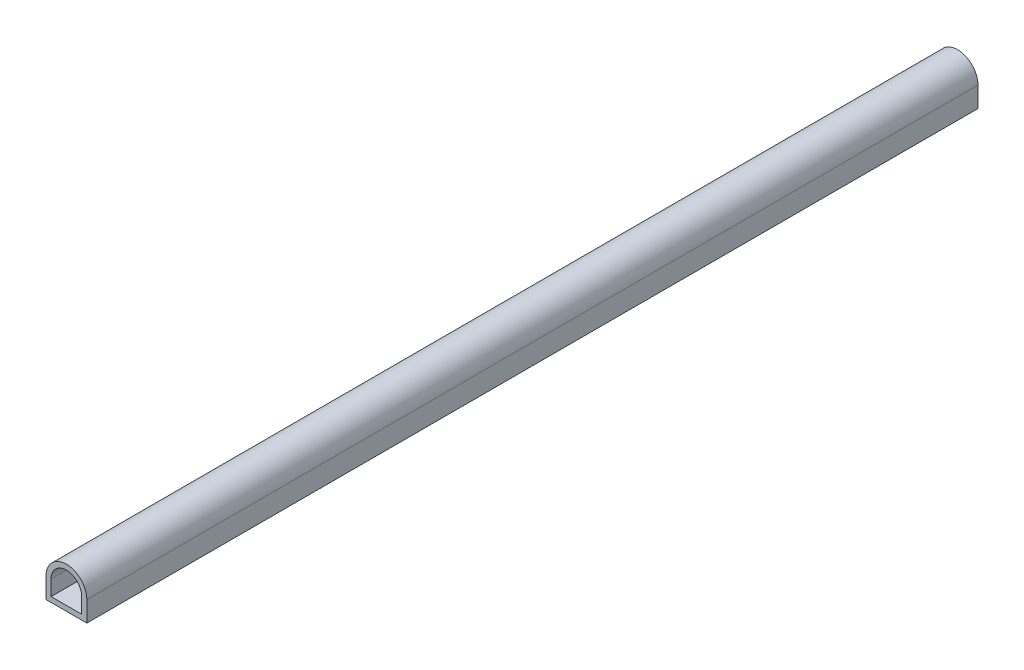
ISO-10303-21;
HEADER;
FILE_DESCRIPTION(('STEP AP214'),'2;1');
FILE_NAME('part.step','',(''),(''),'','','');
FILE_SCHEMA(('AUTOMOTIVE_DESIGN { 1 0 10303 214 1 1 1 1 }'));
ENDSEC;
DATA;
#1=APPLICATION_CONTEXT('core data for automotive mechanical design processes');
#2=APPLICATION_PROTOCOL_DEFINITION('international standard','automotive_design',2000,#1);
#3=PRODUCT_CONTEXT('',#1,'mechanical');
#4=PRODUCT('Part','Part','',(#3));
#5=PRODUCT_RELATED_PRODUCT_CATEGORY('part','',(#4));
#6=PRODUCT_DEFINITION_FORMATION('','',#4);
#7=PRODUCT_DEFINITION_CONTEXT('part definition',#1,'design');
#8=PRODUCT_DEFINITION('design','',#6,#7);
#9=PRODUCT_DEFINITION_SHAPE('','',#8);
#10=(LENGTH_UNIT() NAMED_UNIT(*) SI_UNIT(.MILLI.,.METRE.));
#11=(NAMED_UNIT(*) PLANE_ANGLE_UNIT() SI_UNIT($,.RADIAN.));
#12=(NAMED_UNIT(*) SI_UNIT($,.STERADIAN.) SOLID_ANGLE_UNIT());
#13=UNCERTAINTY_MEASURE_WITH_UNIT(LENGTH_MEASURE(1.E-05),#10,'distance_accuracy_value','');
#14=(GEOMETRIC_REPRESENTATION_CONTEXT(3) GLOBAL_UNCERTAINTY_ASSIGNED_CONTEXT((#13)) GLOBAL_UNIT_ASSIGNED_CONTEXT((#10,
#11,#12)) REPRESENTATION_CONTEXT('',''));
#15=CARTESIAN_POINT('',(0.,0.,0.));
#16=DIRECTION('',(0.,0.,1.));
#17=DIRECTION('',(1.,0.,0.));
#18=AXIS2_PLACEMENT_3D('',#15,#16,#17);
#19=CARTESIAN_POINT('',(0.,0.,131.));
#20=DIRECTION('',(0.,0.,1.));
#21=DIRECTION('',(1.,0.,0.));
#22=AXIS2_PLACEMENT_3D('',#19,#20,#21);
#23=PLANE('',#22);
#24=DIRECTION('',(0.,-1.,0.));
#25=VECTOR('',#24,1.);
#26=CARTESIAN_POINT('',(-3.,-3.,131.));
#27=LINE('',#26,#25);
#28=CARTESIAN_POINT('',(-3.,0.,131.));
#29=VERTEX_POINT('',#28);
#30=CARTESIAN_POINT('',(-3.,-3.,131.));
#31=VERTEX_POINT('',#30);
#32=EDGE_CURVE('E131',#29,#31,#27,.T.);
#33=ORIENTED_EDGE('',*,*,#32,.T.);
#34=DIRECTION('',(1.,0.,0.));
#35=VECTOR('',#34,1.);
#36=CARTESIAN_POINT('',(-3.,-3.,131.));
#37=LINE('',#36,#35);
#38=CARTESIAN_POINT('',(3.,-3.,131.));
#39=VERTEX_POINT('',#38);
#40=EDGE_CURVE('E134',#31,#39,#37,.T.);
#41=ORIENTED_EDGE('',*,*,#40,.T.);
#42=DIRECTION('',(0.,1.,0.));
#43=VECTOR('',#42,1.);
#44=CARTESIAN_POINT('',(3.,-3.,131.));
#45=LINE('',#44,#43);
#46=CARTESIAN_POINT('',(3.,0.,131.));
#47=VERTEX_POINT('',#46);
#48=EDGE_CURVE('E137',#39,#47,#45,.T.);
#49=ORIENTED_EDGE('',*,*,#48,.T.);
#50=CARTESIAN_POINT('',(0.,0.,131.));
#51=DIRECTION('',(0.,0.,1.));
#52=DIRECTION('',(1.,0.,0.));
#53=AXIS2_PLACEMENT_3D('',#50,#51,#52);
#54=CIRCLE('',#53,3.);
#55=EDGE_CURVE('E139',#47,#29,#54,.T.);
#56=ORIENTED_EDGE('',*,*,#55,.T.);
#57=EDGE_LOOP('',(#33,#41,#49,#56));
#58=FACE_BOUND('',#57,.T.);
#59=DIRECTION('',(1.,0.,0.));
#60=VECTOR('',#59,1.);
#61=CARTESIAN_POINT('',(-2.25,-2.25,131.));
#62=LINE('',#61,#60);
#63=CARTESIAN_POINT('',(-2.25,-2.25,131.));
#64=VERTEX_POINT('',#63);
#65=CARTESIAN_POINT('',(2.25,-2.25,131.));
#66=VERTEX_POINT('',#65);
#67=EDGE_CURVE('E103',#64,#66,#62,.T.);
#68=ORIENTED_EDGE('',*,*,#67,.F.);
#69=DIRECTION('',(0.,-1.,0.));
#70=VECTOR('',#69,1.);
#71=CARTESIAN_POINT('',(-2.25,-2.25,131.));
#72=LINE('',#71,#70);
#73=CARTESIAN_POINT('',(-2.25,0.,131.));
#74=VERTEX_POINT('',#73);
#75=EDGE_CURVE('E95',#74,#64,#72,.T.);
#76=ORIENTED_EDGE('',*,*,#75,.F.);
#77=CARTESIAN_POINT('',(0.,0.,131.));
#78=DIRECTION('',(0.,0.,1.));
#79=DIRECTION('',(1.,0.,0.));
#80=AXIS2_PLACEMENT_3D('',#77,#78,#79);
#81=CIRCLE('',#80,2.25);
#82=CARTESIAN_POINT('',(2.25,0.,131.));
#83=VERTEX_POINT('',#82);
#84=EDGE_CURVE('E117',#83,#74,#81,.T.);
#85=ORIENTED_EDGE('',*,*,#84,.F.);
#86=DIRECTION('',(0.,1.,0.));
#87=VECTOR('',#86,1.);
#88=CARTESIAN_POINT('',(2.25,-2.25,131.));
#89=LINE('',#88,#87);
#90=EDGE_CURVE('E115',#66,#83,#89,.T.);
#91=ORIENTED_EDGE('',*,*,#90,.F.);
#92=EDGE_LOOP('',(#68,#76,#85,#91));
#93=FACE_BOUND('',#92,.T.);
#94=ADVANCED_FACE('F30',(#58,#93),#23,.T.);
#95=CARTESIAN_POINT('',(0.,0.,0.));
#96=DIRECTION('',(0.,0.,1.));
#97=DIRECTION('',(1.,0.,0.));
#98=AXIS2_PLACEMENT_3D('',#95,#96,#97);
#99=PLANE('',#98);
#100=DIRECTION('',(0.,-1.,0.));
#101=VECTOR('',#100,1.);
#102=CARTESIAN_POINT('',(-3.,-3.,0.));
#103=LINE('',#102,#101);
#104=CARTESIAN_POINT('',(-3.,0.,0.));
#105=VERTEX_POINT('',#104);
#106=CARTESIAN_POINT('',(-3.,-3.,0.));
#107=VERTEX_POINT('',#106);
#108=EDGE_CURVE('E111',#105,#107,#103,.T.);
#109=ORIENTED_EDGE('',*,*,#108,.F.);
#110=CARTESIAN_POINT('',(0.,0.,0.));
#111=DIRECTION('',(0.,0.,1.));
#112=DIRECTION('',(1.,0.,0.));
#113=AXIS2_PLACEMENT_3D('',#110,#111,#112);
#114=CIRCLE('',#113,3.);
#115=CARTESIAN_POINT('',(3.,0.,0.));
#116=VERTEX_POINT('',#115);
#117=EDGE_CURVE('E135',#116,#105,#114,.T.);
#118=ORIENTED_EDGE('',*,*,#117,.F.);
#119=DIRECTION('',(0.,1.,0.));
#120=VECTOR('',#119,1.);
#121=CARTESIAN_POINT('',(3.,-3.,0.));
#122=LINE('',#121,#120);
#123=CARTESIAN_POINT('',(3.,-3.,0.));
#124=VERTEX_POINT('',#123);
#125=EDGE_CURVE('E146',#124,#116,#122,.T.);
#126=ORIENTED_EDGE('',*,*,#125,.F.);
#127=DIRECTION('',(1.,0.,0.));
#128=VECTOR('',#127,1.);
#129=CARTESIAN_POINT('',(-3.,-3.,0.));
#130=LINE('',#129,#128);
#131=EDGE_CURVE('E144',#107,#124,#130,.T.);
#132=ORIENTED_EDGE('',*,*,#131,.F.);
#133=EDGE_LOOP('',(#109,#118,#126,#132));
#134=FACE_BOUND('',#133,.T.);
#135=DIRECTION('',(0.,-1.,0.));
#136=VECTOR('',#135,1.);
#137=CARTESIAN_POINT('',(-2.25,-2.25,0.));
#138=LINE('',#137,#136);
#139=CARTESIAN_POINT('',(-2.25,0.,0.));
#140=VERTEX_POINT('',#139);
#141=CARTESIAN_POINT('',(-2.25,-2.25,0.));
#142=VERTEX_POINT('',#141);
#143=EDGE_CURVE('E53',#140,#142,#138,.T.);
#144=ORIENTED_EDGE('',*,*,#143,.T.);
#145=DIRECTION('',(1.,0.,0.));
#146=VECTOR('',#145,1.);
#147=CARTESIAN_POINT('',(-2.25,-2.25,0.));
#148=LINE('',#147,#146);
#149=CARTESIAN_POINT('',(2.25,-2.25,0.));
#150=VERTEX_POINT('',#149);
#151=EDGE_CURVE('E110',#142,#150,#148,.T.);
#152=ORIENTED_EDGE('',*,*,#151,.T.);
#153=DIRECTION('',(0.,1.,0.));
#154=VECTOR('',#153,1.);
#155=CARTESIAN_POINT('',(2.25,-2.25,0.));
#156=LINE('',#155,#154);
#157=CARTESIAN_POINT('',(2.25,0.,0.));
#158=VERTEX_POINT('',#157);
#159=EDGE_CURVE('E123',#150,#158,#156,.T.);
#160=ORIENTED_EDGE('',*,*,#159,.T.);
#161=CARTESIAN_POINT('',(0.,0.,0.));
#162=DIRECTION('',(0.,0.,1.));
#163=DIRECTION('',(1.,0.,0.));
#164=AXIS2_PLACEMENT_3D('',#161,#162,#163);
#165=CIRCLE('',#164,2.25);
#166=EDGE_CURVE('E104',#158,#140,#165,.T.);
#167=ORIENTED_EDGE('',*,*,#166,.T.);
#168=EDGE_LOOP('',(#144,#152,#160,#167));
#169=FACE_BOUND('',#168,.T.);
#170=ADVANCED_FACE('F164',(#134,#169),#99,.F.);
#171=CARTESIAN_POINT('',(-3.,-3.,131.));
#172=DIRECTION('',(1.,0.,0.));
#173=DIRECTION('',(0.,0.,-1.));
#174=AXIS2_PLACEMENT_3D('',#171,#172,#173);
#175=PLANE('',#174);
#176=ORIENTED_EDGE('',*,*,#108,.T.);
#177=DIRECTION('',(0.,0.,-1.));
#178=VECTOR('',#177,1.);
#179=CARTESIAN_POINT('',(-3.,-3.,131.));
#180=LINE('',#179,#178);
#181=EDGE_CURVE('E11',#31,#107,#180,.T.);
#182=ORIENTED_EDGE('',*,*,#181,.F.);
#183=ORIENTED_EDGE('',*,*,#32,.F.);
#184=DIRECTION('',(0.,0.,-1.));
#185=VECTOR('',#184,1.);
#186=CARTESIAN_POINT('',(-3.,0.,131.));
#187=LINE('',#186,#185);
#188=EDGE_CURVE('E141',#29,#105,#187,.T.);
#189=ORIENTED_EDGE('',*,*,#188,.T.);
#190=EDGE_LOOP('',(#176,#182,#183,#189));
#191=FACE_BOUND('',#190,.T.);
#192=ADVANCED_FACE('F32',(#191),#175,.F.);
#193=CARTESIAN_POINT('',(-3.,-3.,131.));
#194=DIRECTION('',(0.,1.,0.));
#195=DIRECTION('',(0.,0.,1.));
#196=AXIS2_PLACEMENT_3D('',#193,#194,#195);
#197=PLANE('',#196);
#198=ORIENTED_EDGE('',*,*,#131,.T.);
#199=DIRECTION('',(0.,0.,-1.));
#200=VECTOR('',#199,1.);
#201=CARTESIAN_POINT('',(3.,-3.,131.));
#202=LINE('',#201,#200);
#203=EDGE_CURVE('E38',#39,#124,#202,.T.);
#204=ORIENTED_EDGE('',*,*,#203,.F.);
#205=ORIENTED_EDGE('',*,*,#40,.F.);
#206=ORIENTED_EDGE('',*,*,#181,.T.);
#207=EDGE_LOOP('',(#198,#204,#205,#206));
#208=FACE_BOUND('',#207,.T.);
#209=ADVANCED_FACE('F174',(#208),#197,.F.);
#210=CARTESIAN_POINT('',(3.,-3.,131.));
#211=DIRECTION('',(-1.,0.,0.));
#212=DIRECTION('',(0.,0.,1.));
#213=AXIS2_PLACEMENT_3D('',#210,#211,#212);
#214=PLANE('',#213);
#215=ORIENTED_EDGE('',*,*,#125,.T.);
#216=DIRECTION('',(0.,0.,-1.));
#217=VECTOR('',#216,1.);
#218=CARTESIAN_POINT('',(3.,0.,131.));
#219=LINE('',#218,#217);
#220=EDGE_CURVE('E151',#47,#116,#219,.T.);
#221=ORIENTED_EDGE('',*,*,#220,.F.);
#222=ORIENTED_EDGE('',*,*,#48,.F.);
#223=ORIENTED_EDGE('',*,*,#203,.T.);
#224=EDGE_LOOP('',(#215,#221,#222,#223));
#225=FACE_BOUND('',#224,.T.);
#226=ADVANCED_FACE('F158',(#225),#214,.F.);
#227=CARTESIAN_POINT('',(0.,0.,131.));
#228=DIRECTION('',(0.,0.,-1.));
#229=DIRECTION('',(-1.,0.,0.));
#230=AXIS2_PLACEMENT_3D('',#227,#228,#229);
#231=CYLINDRICAL_SURFACE('',#230,3.);
#232=ORIENTED_EDGE('',*,*,#117,.T.);
#233=ORIENTED_EDGE('',*,*,#188,.F.);
#234=ORIENTED_EDGE('',*,*,#55,.F.);
#235=ORIENTED_EDGE('',*,*,#220,.T.);
#236=EDGE_LOOP('',(#232,#233,#234,#235));
#237=FACE_BOUND('',#236,.T.);
#238=ADVANCED_FACE('F168',(#237),#231,.T.);
#239=CARTESIAN_POINT('',(-2.25,-2.25,131.));
#240=DIRECTION('',(1.,0.,0.));
#241=DIRECTION('',(0.,0.,-1.));
#242=AXIS2_PLACEMENT_3D('',#239,#240,#241);
#243=PLANE('',#242);
#244=ORIENTED_EDGE('',*,*,#143,.F.);
#245=DIRECTION('',(0.,0.,-1.));
#246=VECTOR('',#245,1.);
#247=CARTESIAN_POINT('',(-2.25,0.,131.));
#248=LINE('',#247,#246);
#249=EDGE_CURVE('E99',#74,#140,#248,.T.);
#250=ORIENTED_EDGE('',*,*,#249,.F.);
#251=ORIENTED_EDGE('',*,*,#75,.T.);
#252=DIRECTION('',(0.,0.,-1.));
#253=VECTOR('',#252,1.);
#254=CARTESIAN_POINT('',(-2.25,-2.25,131.));
#255=LINE('',#254,#253);
#256=EDGE_CURVE('E98',#64,#142,#255,.T.);
#257=ORIENTED_EDGE('',*,*,#256,.T.);
#258=EDGE_LOOP('',(#244,#250,#251,#257));
#259=FACE_BOUND('',#258,.T.);
#260=ADVANCED_FACE('F97',(#259),#243,.T.);
#261=CARTESIAN_POINT('',(-2.25,-2.25,131.));
#262=DIRECTION('',(0.,1.,0.));
#263=DIRECTION('',(0.,0.,1.));
#264=AXIS2_PLACEMENT_3D('',#261,#262,#263);
#265=PLANE('',#264);
#266=ORIENTED_EDGE('',*,*,#151,.F.);
#267=ORIENTED_EDGE('',*,*,#256,.F.);
#268=ORIENTED_EDGE('',*,*,#67,.T.);
#269=DIRECTION('',(0.,0.,-1.));
#270=VECTOR('',#269,1.);
#271=CARTESIAN_POINT('',(2.25,-2.25,131.));
#272=LINE('',#271,#270);
#273=EDGE_CURVE('E112',#66,#150,#272,.T.);
#274=ORIENTED_EDGE('',*,*,#273,.T.);
#275=EDGE_LOOP('',(#266,#267,#268,#274));
#276=FACE_BOUND('',#275,.T.);
#277=ADVANCED_FACE('F107',(#276),#265,.T.);
#278=CARTESIAN_POINT('',(2.25,-2.25,131.));
#279=DIRECTION('',(-1.,0.,0.));
#280=DIRECTION('',(0.,0.,1.));
#281=AXIS2_PLACEMENT_3D('',#278,#279,#280);
#282=PLANE('',#281);
#283=ORIENTED_EDGE('',*,*,#159,.F.);
#284=ORIENTED_EDGE('',*,*,#273,.F.);
#285=ORIENTED_EDGE('',*,*,#90,.T.);
#286=DIRECTION('',(0.,0.,-1.));
#287=VECTOR('',#286,1.);
#288=CARTESIAN_POINT('',(2.25,0.,131.));
#289=LINE('',#288,#287);
#290=EDGE_CURVE('E45',#83,#158,#289,.T.);
#291=ORIENTED_EDGE('',*,*,#290,.T.);
#292=EDGE_LOOP('',(#283,#284,#285,#291));
#293=FACE_BOUND('',#292,.T.);
#294=ADVANCED_FACE('F197',(#293),#282,.T.);
#295=CARTESIAN_POINT('',(0.,0.,131.));
#296=DIRECTION('',(0.,0.,-1.));
#297=DIRECTION('',(-1.,0.,0.));
#298=AXIS2_PLACEMENT_3D('',#295,#296,#297);
#299=CYLINDRICAL_SURFACE('',#298,2.25);
#300=ORIENTED_EDGE('',*,*,#166,.F.);
#301=ORIENTED_EDGE('',*,*,#290,.F.);
#302=ORIENTED_EDGE('',*,*,#84,.T.);
#303=ORIENTED_EDGE('',*,*,#249,.T.);
#304=EDGE_LOOP('',(#300,#301,#302,#303));
#305=FACE_BOUND('',#304,.T.);
#306=ADVANCED_FACE('F201',(#305),#299,.F.);
#307=CLOSED_SHELL('',(#94,#170,#192,#209,#226,#238,#260,#277,#294,#306));
#308=MANIFOLD_SOLID_BREP('B2',#307);
#309=ADVANCED_BREP_SHAPE_REPRESENTATION('',(#18,#308),#14);
#310=SHAPE_DEFINITION_REPRESENTATION(#9,#309);
ENDSEC;
END-ISO-10303-21;
